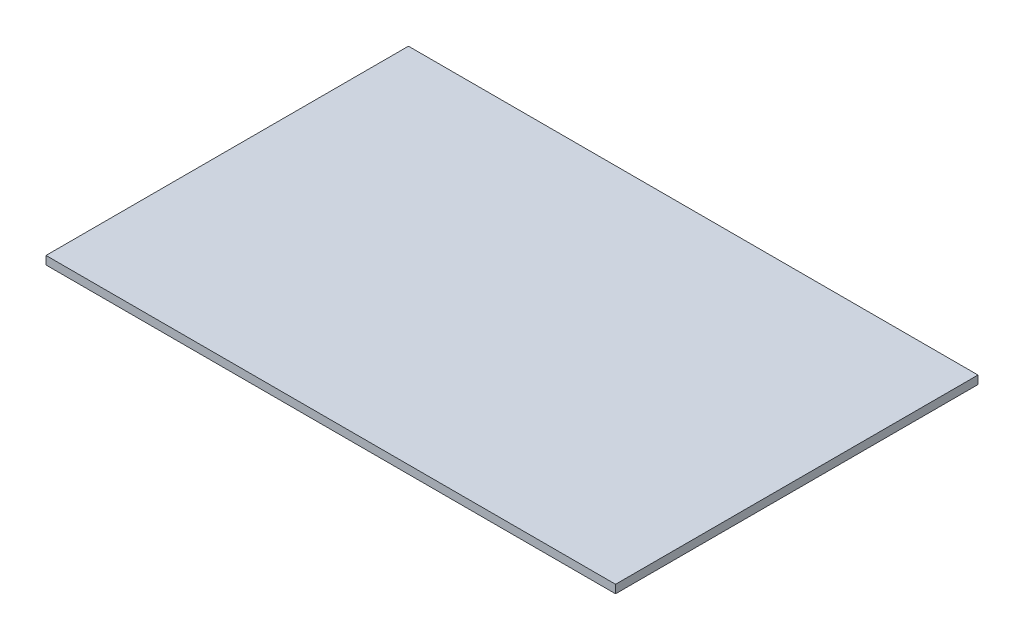
ISO-10303-21;
HEADER;
FILE_DESCRIPTION(('STEP AP214'),'2;1');
FILE_NAME('part.step','',(''),(''),'','','');
FILE_SCHEMA(('AUTOMOTIVE_DESIGN { 1 0 10303 214 1 1 1 1 }'));
ENDSEC;
DATA;
#1=APPLICATION_CONTEXT('core data for automotive mechanical design processes');
#2=APPLICATION_PROTOCOL_DEFINITION('international standard','automotive_design',2000,#1);
#3=PRODUCT_CONTEXT('',#1,'mechanical');
#4=PRODUCT('Part','Part','',(#3));
#5=PRODUCT_RELATED_PRODUCT_CATEGORY('part','',(#4));
#6=PRODUCT_DEFINITION_FORMATION('','',#4);
#7=PRODUCT_DEFINITION_CONTEXT('part definition',#1,'design');
#8=PRODUCT_DEFINITION('design','',#6,#7);
#9=PRODUCT_DEFINITION_SHAPE('','',#8);
#10=(LENGTH_UNIT() NAMED_UNIT(*) SI_UNIT(.MILLI.,.METRE.));
#11=(NAMED_UNIT(*) PLANE_ANGLE_UNIT() SI_UNIT($,.RADIAN.));
#12=(NAMED_UNIT(*) SI_UNIT($,.STERADIAN.) SOLID_ANGLE_UNIT());
#13=UNCERTAINTY_MEASURE_WITH_UNIT(LENGTH_MEASURE(1.E-05),#10,'distance_accuracy_value','');
#14=(GEOMETRIC_REPRESENTATION_CONTEXT(3) GLOBAL_UNCERTAINTY_ASSIGNED_CONTEXT((#13)) GLOBAL_UNIT_ASSIGNED_CONTEXT((#10,
#11,#12)) REPRESENTATION_CONTEXT('',''));
#15=CARTESIAN_POINT('',(0.,0.,0.));
#16=DIRECTION('',(0.,0.,1.));
#17=DIRECTION('',(1.,0.,0.));
#18=AXIS2_PLACEMENT_3D('',#15,#16,#17);
#19=CARTESIAN_POINT('',(-2.86,0.08,-1.88));
#20=DIRECTION('',(0.,1.,0.));
#21=DIRECTION('',(1.,0.,0.));
#22=AXIS2_PLACEMENT_3D('',#19,#20,#21);
#23=PLANE('',#22);
#24=DIRECTION('',(0.,0.,1.));
#25=VECTOR('',#24,1.);
#26=CARTESIAN_POINT('',(2.75,0.0799999999999999,-3.7));
#27=LINE('',#26,#25);
#28=CARTESIAN_POINT('',(2.75,0.0799999999999999,-5.45));
#29=VERTEX_POINT('',#28);
#30=CARTESIAN_POINT('',(2.75,0.0799999999999999,-1.95));
#31=VERTEX_POINT('',#30);
#32=EDGE_CURVE('E53',#29,#31,#27,.T.);
#33=ORIENTED_EDGE('',*,*,#32,.F.);
#34=DIRECTION('',(-1.,0.,0.));
#35=VECTOR('',#34,1.);
#36=CARTESIAN_POINT('',(0.,0.0799999999999999,-5.45));
#37=LINE('',#36,#35);
#38=CARTESIAN_POINT('',(-2.75,0.0799999999999999,-5.45));
#39=VERTEX_POINT('',#38);
#40=EDGE_CURVE('E68',#29,#39,#37,.T.);
#41=ORIENTED_EDGE('',*,*,#40,.T.);
#42=DIRECTION('',(0.,0.,1.));
#43=VECTOR('',#42,1.);
#44=CARTESIAN_POINT('',(-2.75,0.0799999999999999,-3.7));
#45=LINE('',#44,#43);
#46=CARTESIAN_POINT('',(-2.75,0.0799999999999999,-1.95));
#47=VERTEX_POINT('',#46);
#48=EDGE_CURVE('E20',#39,#47,#45,.T.);
#49=ORIENTED_EDGE('',*,*,#48,.T.);
#50=DIRECTION('',(-1.,0.,0.));
#51=VECTOR('',#50,1.);
#52=CARTESIAN_POINT('',(0.,0.0799999999999999,-1.95));
#53=LINE('',#52,#51);
#54=EDGE_CURVE('E58',#31,#47,#53,.T.);
#55=ORIENTED_EDGE('',*,*,#54,.F.);
#56=EDGE_LOOP('',(#33,#41,#49,#55));
#57=FACE_BOUND('',#56,.T.);
#58=ADVANCED_FACE('F16',(#57),#23,.T.);
#59=CARTESIAN_POINT('',(-2.75,0.08782363189318,-5.52));
#60=DIRECTION('',(1.,0.,0.));
#61=DIRECTION('',(0.,0.,1.));
#62=AXIS2_PLACEMENT_3D('',#59,#60,#61);
#63=PLANE('',#62);
#64=ORIENTED_EDGE('',*,*,#48,.F.);
#65=DIRECTION('',(0.,-1.,0.));
#66=VECTOR('',#65,1.);
#67=CARTESIAN_POINT('',(-2.75,0.0399999999999995,-5.45));
#68=LINE('',#67,#66);
#69=CARTESIAN_POINT('',(-2.75,0.,-5.45));
#70=VERTEX_POINT('',#69);
#71=EDGE_CURVE('E81',#39,#70,#68,.T.);
#72=ORIENTED_EDGE('',*,*,#71,.T.);
#73=DIRECTION('',(0.,0.,1.));
#74=VECTOR('',#73,1.);
#75=CARTESIAN_POINT('',(-2.75,0.,-3.7));
#76=LINE('',#75,#74);
#77=CARTESIAN_POINT('',(-2.75,0.,-1.95));
#78=VERTEX_POINT('',#77);
#79=EDGE_CURVE('E74',#70,#78,#76,.T.);
#80=ORIENTED_EDGE('',*,*,#79,.T.);
#81=DIRECTION('',(0.,-1.,0.));
#82=VECTOR('',#81,1.);
#83=CARTESIAN_POINT('',(-2.75,0.0399999999999995,-1.95));
#84=LINE('',#83,#82);
#85=EDGE_CURVE('E63',#47,#78,#84,.T.);
#86=ORIENTED_EDGE('',*,*,#85,.F.);
#87=EDGE_LOOP('',(#64,#72,#80,#86));
#88=FACE_BOUND('',#87,.T.);
#89=ADVANCED_FACE('F73',(#88),#63,.F.);
#90=CARTESIAN_POINT('',(-2.86,-0.007823631893181,-1.95));
#91=DIRECTION('',(0.,0.,1.));
#92=DIRECTION('',(1.,0.,0.));
#93=AXIS2_PLACEMENT_3D('',#90,#91,#92);
#94=PLANE('',#93);
#95=ORIENTED_EDGE('',*,*,#54,.T.);
#96=ORIENTED_EDGE('',*,*,#85,.T.);
#97=DIRECTION('',(1.,0.,0.));
#98=VECTOR('',#97,1.);
#99=CARTESIAN_POINT('',(0.,0.,-1.95));
#100=LINE('',#99,#98);
#101=CARTESIAN_POINT('',(2.75,0.,-1.95));
#102=VERTEX_POINT('',#101);
#103=EDGE_CURVE('E84',#78,#102,#100,.T.);
#104=ORIENTED_EDGE('',*,*,#103,.T.);
#105=DIRECTION('',(0.,-1.,0.));
#106=VECTOR('',#105,1.);
#107=CARTESIAN_POINT('',(2.75,0.0399999999999995,-1.95));
#108=LINE('',#107,#106);
#109=EDGE_CURVE('E65',#31,#102,#108,.T.);
#110=ORIENTED_EDGE('',*,*,#109,.F.);
#111=EDGE_LOOP('',(#95,#96,#104,#110));
#112=FACE_BOUND('',#111,.T.);
#113=ADVANCED_FACE('F60',(#112),#94,.T.);
#114=CARTESIAN_POINT('',(2.75,-0.007823631893181,-1.88));
#115=DIRECTION('',(1.,0.,0.));
#116=DIRECTION('',(0.,0.,-1.));
#117=AXIS2_PLACEMENT_3D('',#114,#115,#116);
#118=PLANE('',#117);
#119=ORIENTED_EDGE('',*,*,#32,.T.);
#120=ORIENTED_EDGE('',*,*,#109,.T.);
#121=DIRECTION('',(0.,0.,-1.));
#122=VECTOR('',#121,1.);
#123=CARTESIAN_POINT('',(2.75,0.,-3.7));
#124=LINE('',#123,#122);
#125=CARTESIAN_POINT('',(2.75,0.,-5.45));
#126=VERTEX_POINT('',#125);
#127=EDGE_CURVE('E26',#102,#126,#124,.T.);
#128=ORIENTED_EDGE('',*,*,#127,.T.);
#129=DIRECTION('',(0.,1.,0.));
#130=VECTOR('',#129,1.);
#131=CARTESIAN_POINT('',(2.75,0.0399999999999995,-5.45));
#132=LINE('',#131,#130);
#133=EDGE_CURVE('E34',#126,#29,#132,.T.);
#134=ORIENTED_EDGE('',*,*,#133,.T.);
#135=EDGE_LOOP('',(#119,#120,#128,#134));
#136=FACE_BOUND('',#135,.T.);
#137=ADVANCED_FACE('F88',(#136),#118,.T.);
#138=CARTESIAN_POINT('',(2.86,0.08782363189318,-5.45));
#139=DIRECTION('',(0.,0.,1.));
#140=DIRECTION('',(-1.,0.,0.));
#141=AXIS2_PLACEMENT_3D('',#138,#139,#140);
#142=PLANE('',#141);
#143=ORIENTED_EDGE('',*,*,#40,.F.);
#144=ORIENTED_EDGE('',*,*,#133,.F.);
#145=DIRECTION('',(-1.,0.,0.));
#146=VECTOR('',#145,1.);
#147=CARTESIAN_POINT('',(0.,0.,-5.45));
#148=LINE('',#147,#146);
#149=EDGE_CURVE('E11',#126,#70,#148,.T.);
#150=ORIENTED_EDGE('',*,*,#149,.T.);
#151=ORIENTED_EDGE('',*,*,#71,.F.);
#152=EDGE_LOOP('',(#143,#144,#150,#151));
#153=FACE_BOUND('',#152,.T.);
#154=ADVANCED_FACE('F90',(#153),#142,.F.);
#155=CARTESIAN_POINT('',(-2.86,0.,-1.88));
#156=DIRECTION('',(0.,1.,0.));
#157=DIRECTION('',(1.,0.,0.));
#158=AXIS2_PLACEMENT_3D('',#155,#156,#157);
#159=PLANE('',#158);
#160=ORIENTED_EDGE('',*,*,#127,.F.);
#161=ORIENTED_EDGE('',*,*,#103,.F.);
#162=ORIENTED_EDGE('',*,*,#79,.F.);
#163=ORIENTED_EDGE('',*,*,#149,.F.);
#164=EDGE_LOOP('',(#160,#161,#162,#163));
#165=FACE_BOUND('',#164,.T.);
#166=ADVANCED_FACE('F18',(#165),#159,.F.);
#167=CLOSED_SHELL('',(#58,#89,#113,#137,#154,#166));
#168=MANIFOLD_SOLID_BREP('B1',#167);
#169=ADVANCED_BREP_SHAPE_REPRESENTATION('',(#18,#168),#14);
#170=SHAPE_DEFINITION_REPRESENTATION(#9,#169);
ENDSEC;
END-ISO-10303-21;
